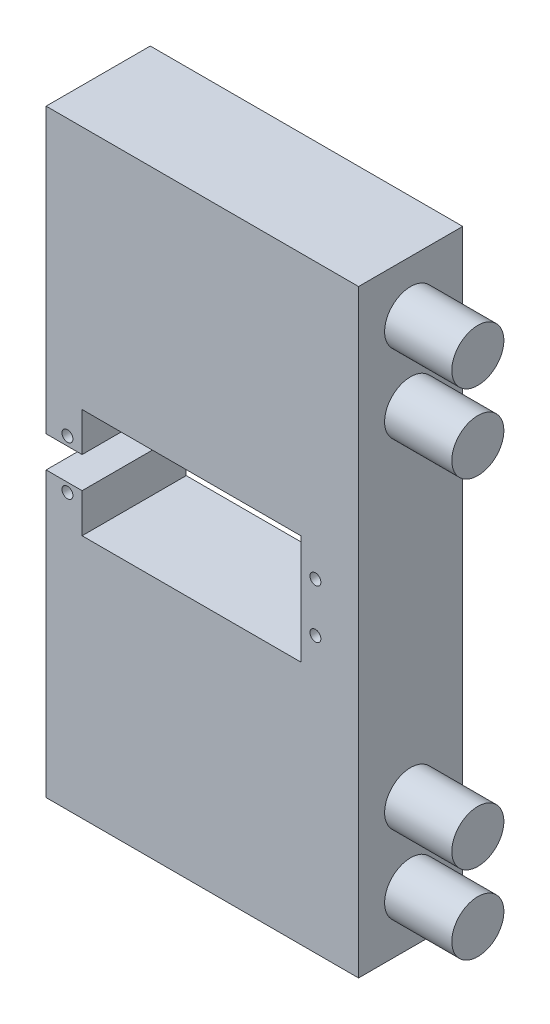
ISO-10303-21;
HEADER;
FILE_DESCRIPTION(('STEP AP214'),'2;1');
FILE_NAME('part.step','',(''),(''),'','','');
FILE_SCHEMA(('AUTOMOTIVE_DESIGN { 1 0 10303 214 1 1 1 1 }'));
ENDSEC;
DATA;
#1=APPLICATION_CONTEXT('core data for automotive mechanical design processes');
#2=APPLICATION_PROTOCOL_DEFINITION('international standard','automotive_design',2000,#1);
#3=PRODUCT_CONTEXT('',#1,'mechanical');
#4=PRODUCT('Part','Part','',(#3));
#5=PRODUCT_RELATED_PRODUCT_CATEGORY('part','',(#4));
#6=PRODUCT_DEFINITION_FORMATION('','',#4);
#7=PRODUCT_DEFINITION_CONTEXT('part definition',#1,'design');
#8=PRODUCT_DEFINITION('design','',#6,#7);
#9=PRODUCT_DEFINITION_SHAPE('','',#8);
#10=(LENGTH_UNIT() NAMED_UNIT(*) SI_UNIT(.MILLI.,.METRE.));
#11=(NAMED_UNIT(*) PLANE_ANGLE_UNIT() SI_UNIT($,.RADIAN.));
#12=(NAMED_UNIT(*) SI_UNIT($,.STERADIAN.) SOLID_ANGLE_UNIT());
#13=UNCERTAINTY_MEASURE_WITH_UNIT(LENGTH_MEASURE(1.E-05),#10,'distance_accuracy_value','');
#14=(GEOMETRIC_REPRESENTATION_CONTEXT(3) GLOBAL_UNCERTAINTY_ASSIGNED_CONTEXT((#13)) GLOBAL_UNIT_ASSIGNED_CONTEXT((#10,
#11,#12)) REPRESENTATION_CONTEXT('',''));
#15=CARTESIAN_POINT('',(0.,0.,0.));
#16=DIRECTION('',(0.,0.,1.));
#17=DIRECTION('',(1.,0.,0.));
#18=AXIS2_PLACEMENT_3D('',#15,#16,#17);
#19=CARTESIAN_POINT('',(0.,0.,0.));
#20=DIRECTION('',(0.,0.,1.));
#21=DIRECTION('',(1.,0.,0.));
#22=AXIS2_PLACEMENT_3D('',#19,#20,#21);
#23=PLANE('',#22);
#24=DIRECTION('',(0.,-1.,0.));
#25=VECTOR('',#24,1.);
#26=CARTESIAN_POINT('',(74.5,48.,0.));
#27=LINE('',#26,#25);
#28=CARTESIAN_POINT('',(74.5,48.,0.));
#29=VERTEX_POINT('',#28);
#30=CARTESIAN_POINT('',(74.5,27.,0.));
#31=VERTEX_POINT('',#30);
#32=EDGE_CURVE('E127',#29,#31,#27,.T.);
#33=ORIENTED_EDGE('',*,*,#32,.T.);
#34=DIRECTION('',(1.,0.,0.));
#35=VECTOR('',#34,1.);
#36=CARTESIAN_POINT('',(74.5,27.,0.));
#37=LINE('',#36,#35);
#38=CARTESIAN_POINT('',(95.5,27.,0.));
#39=VERTEX_POINT('',#38);
#40=EDGE_CURVE('E270',#31,#39,#37,.T.);
#41=ORIENTED_EDGE('',*,*,#40,.T.);
#42=DIRECTION('',(0.,-1.,0.));
#43=VECTOR('',#42,1.);
#44=CARTESIAN_POINT('',(95.5,48.,0.));
#45=LINE('',#44,#43);
#46=CARTESIAN_POINT('',(95.5,48.,0.));
#47=VERTEX_POINT('',#46);
#48=EDGE_CURVE('E296',#47,#39,#45,.T.);
#49=ORIENTED_EDGE('',*,*,#48,.F.);
#50=DIRECTION('',(1.,0.,0.));
#51=VECTOR('',#50,1.);
#52=CARTESIAN_POINT('',(74.5,48.,0.));
#53=LINE('',#52,#51);
#54=EDGE_CURVE('E281',#29,#47,#53,.T.);
#55=ORIENTED_EDGE('',*,*,#54,.F.);
#56=EDGE_LOOP('',(#33,#41,#49,#55));
#57=FACE_BOUND('',#56,.T.);
#58=CARTESIAN_POINT('',(59.19,-7.7,0.));
#59=DIRECTION('',(0.,0.,-1.));
#60=DIRECTION('',(-1.,0.,0.));
#61=AXIS2_PLACEMENT_3D('',#58,#59,#60);
#62=CIRCLE('',#61,1.05);
#63=CARTESIAN_POINT('',(58.14,-7.7,0.));
#64=VERTEX_POINT('',#63);
#65=EDGE_CURVE('E348',#64,#64,#62,.T.);
#66=ORIENTED_EDGE('',*,*,#65,.F.);
#67=EDGE_LOOP('',(#66));
#68=FACE_BOUND('',#67,.T.);
#69=CARTESIAN_POINT('',(106.81,-7.7,0.));
#70=DIRECTION('',(0.,0.,-1.));
#71=DIRECTION('',(-1.,0.,0.));
#72=AXIS2_PLACEMENT_3D('',#69,#70,#71);
#73=CIRCLE('',#72,1.04999999999999);
#74=CARTESIAN_POINT('',(105.76,-7.7,0.));
#75=VERTEX_POINT('',#74);
#76=EDGE_CURVE('E340',#75,#75,#73,.T.);
#77=ORIENTED_EDGE('',*,*,#76,.F.);
#78=EDGE_LOOP('',(#77));
#79=FACE_BOUND('',#78,.T.);
#80=DIRECTION('',(-1.,0.,0.));
#81=VECTOR('',#80,1.);
#82=CARTESIAN_POINT('',(0.,-6.,0.));
#83=LINE('',#82,#81);
#84=CARTESIAN_POINT('',(62.,-6.,0.));
#85=VERTEX_POINT('',#84);
#86=CARTESIAN_POINT('',(55.0953192291233,-6.,0.));
#87=VERTEX_POINT('',#86);
#88=EDGE_CURVE('E482',#85,#87,#83,.T.);
#89=ORIENTED_EDGE('',*,*,#88,.F.);
#90=DIRECTION('',(0.,-1.,0.));
#91=VECTOR('',#90,1.);
#92=CARTESIAN_POINT('',(62.,-6.,0.));
#93=LINE('',#92,#91);
#94=CARTESIAN_POINT('',(62.,-13.5,0.));
#95=VERTEX_POINT('',#94);
#96=EDGE_CURVE('E335',#85,#95,#93,.T.);
#97=ORIENTED_EDGE('',*,*,#96,.T.);
#98=DIRECTION('',(1.,0.,0.));
#99=VECTOR('',#98,1.);
#100=CARTESIAN_POINT('',(62.,-13.5,0.));
#101=LINE('',#100,#99);
#102=CARTESIAN_POINT('',(104.,-13.5,0.));
#103=VERTEX_POINT('',#102);
#104=EDGE_CURVE('E393',#95,#103,#101,.T.);
#105=ORIENTED_EDGE('',*,*,#104,.T.);
#106=DIRECTION('',(0.,-1.,0.));
#107=VECTOR('',#106,1.);
#108=CARTESIAN_POINT('',(104.,7.5,0.));
#109=LINE('',#108,#107);
#110=CARTESIAN_POINT('',(104.,7.5,0.));
#111=VERTEX_POINT('',#110);
#112=EDGE_CURVE('E397',#111,#103,#109,.T.);
#113=ORIENTED_EDGE('',*,*,#112,.F.);
#114=DIRECTION('',(1.,0.,0.));
#115=VECTOR('',#114,1.);
#116=CARTESIAN_POINT('',(62.,7.5,0.));
#117=LINE('',#116,#115);
#118=CARTESIAN_POINT('',(62.,7.5,0.));
#119=VERTEX_POINT('',#118);
#120=EDGE_CURVE('E401',#119,#111,#117,.T.);
#121=ORIENTED_EDGE('',*,*,#120,.F.);
#122=DIRECTION('',(0.,1.,0.));
#123=VECTOR('',#122,1.);
#124=CARTESIAN_POINT('',(62.,0.,0.));
#125=LINE('',#124,#123);
#126=CARTESIAN_POINT('',(62.,0.,0.));
#127=VERTEX_POINT('',#126);
#128=EDGE_CURVE('E367',#127,#119,#125,.T.);
#129=ORIENTED_EDGE('',*,*,#128,.F.);
#130=DIRECTION('',(-1.,0.,0.));
#131=VECTOR('',#130,1.);
#132=CARTESIAN_POINT('',(0.,0.,0.));
#133=LINE('',#132,#131);
#134=CARTESIAN_POINT('',(55.0953192291233,0.,0.));
#135=VERTEX_POINT('',#134);
#136=EDGE_CURVE('E478',#127,#135,#133,.T.);
#137=ORIENTED_EDGE('',*,*,#136,.T.);
#138=DIRECTION('',(0.,-1.,0.));
#139=VECTOR('',#138,1.);
#140=CARTESIAN_POINT('',(55.0953192291233,54.5,0.));
#141=LINE('',#140,#139);
#142=CARTESIAN_POINT('',(55.0953192291233,54.5,0.));
#143=VERTEX_POINT('',#142);
#144=EDGE_CURVE('E450',#143,#135,#141,.T.);
#145=ORIENTED_EDGE('',*,*,#144,.F.);
#146=DIRECTION('',(-1.,0.,0.));
#147=VECTOR('',#146,1.);
#148=CARTESIAN_POINT('',(55.0953192291233,54.5,0.));
#149=LINE('',#148,#147);
#150=CARTESIAN_POINT('',(115.095319229123,54.5,0.));
#151=VERTEX_POINT('',#150);
#152=EDGE_CURVE('E460',#151,#143,#149,.T.);
#153=ORIENTED_EDGE('',*,*,#152,.F.);
#154=DIRECTION('',(0.,1.,0.));
#155=VECTOR('',#154,1.);
#156=CARTESIAN_POINT('',(115.095319229123,54.5,0.));
#157=LINE('',#156,#155);
#158=CARTESIAN_POINT('',(115.095319229123,-60.5,0.));
#159=VERTEX_POINT('',#158);
#160=EDGE_CURVE('E457',#159,#151,#157,.T.);
#161=ORIENTED_EDGE('',*,*,#160,.F.);
#162=DIRECTION('',(1.,0.,0.));
#163=VECTOR('',#162,1.);
#164=CARTESIAN_POINT('',(55.0953192291233,-60.5,0.));
#165=LINE('',#164,#163);
#166=CARTESIAN_POINT('',(55.0953192291233,-60.5,0.));
#167=VERTEX_POINT('',#166);
#168=EDGE_CURVE('E454',#167,#159,#165,.T.);
#169=ORIENTED_EDGE('',*,*,#168,.F.);
#170=EDGE_CURVE('E434',#87,#167,#141,.T.);
#171=ORIENTED_EDGE('',*,*,#170,.F.);
#172=EDGE_LOOP('',(#89,#97,#105,#113,#121,#129,#137,#145,#153,#161,#169,#171));
#173=FACE_BOUND('',#172,.T.);
#174=CARTESIAN_POINT('',(106.81,1.7,0.));
#175=DIRECTION('',(0.,0.,1.));
#176=DIRECTION('',(1.,0.,0.));
#177=AXIS2_PLACEMENT_3D('',#174,#175,#176);
#178=CIRCLE('',#177,1.04999999999999);
#179=CARTESIAN_POINT('',(107.86,1.7,0.));
#180=VERTEX_POINT('',#179);
#181=EDGE_CURVE('E331',#180,#180,#178,.T.);
#182=ORIENTED_EDGE('',*,*,#181,.T.);
#183=EDGE_LOOP('',(#182));
#184=FACE_BOUND('',#183,.T.);
#185=CARTESIAN_POINT('',(59.19,1.7,0.));
#186=DIRECTION('',(0.,0.,1.));
#187=DIRECTION('',(1.,0.,0.));
#188=AXIS2_PLACEMENT_3D('',#185,#186,#187);
#189=CIRCLE('',#188,1.05);
#190=CARTESIAN_POINT('',(60.24,1.7,0.));
#191=VERTEX_POINT('',#190);
#192=EDGE_CURVE('E356',#191,#191,#189,.T.);
#193=ORIENTED_EDGE('',*,*,#192,.T.);
#194=EDGE_LOOP('',(#193));
#195=FACE_BOUND('',#194,.T.);
#196=DIRECTION('',(1.,0.,0.));
#197=VECTOR('',#196,1.);
#198=CARTESIAN_POINT('',(74.5,-54.,0.));
#199=LINE('',#198,#197);
#200=CARTESIAN_POINT('',(74.5,-54.,0.));
#201=VERTEX_POINT('',#200);
#202=CARTESIAN_POINT('',(95.5,-54.,0.));
#203=VERTEX_POINT('',#202);
#204=EDGE_CURVE('E119',#201,#203,#199,.T.);
#205=ORIENTED_EDGE('',*,*,#204,.T.);
#206=DIRECTION('',(0.,1.,0.));
#207=VECTOR('',#206,1.);
#208=CARTESIAN_POINT('',(95.5,-54.,0.));
#209=LINE('',#208,#207);
#210=CARTESIAN_POINT('',(95.5,-33.,0.));
#211=VERTEX_POINT('',#210);
#212=EDGE_CURVE('E264',#203,#211,#209,.T.);
#213=ORIENTED_EDGE('',*,*,#212,.T.);
#214=DIRECTION('',(1.,0.,0.));
#215=VECTOR('',#214,1.);
#216=CARTESIAN_POINT('',(74.5,-33.,0.));
#217=LINE('',#216,#215);
#218=CARTESIAN_POINT('',(74.5,-33.,0.));
#219=VERTEX_POINT('',#218);
#220=EDGE_CURVE('E611',#219,#211,#217,.T.);
#221=ORIENTED_EDGE('',*,*,#220,.F.);
#222=DIRECTION('',(0.,1.,0.));
#223=VECTOR('',#222,1.);
#224=CARTESIAN_POINT('',(74.5,-54.,0.));
#225=LINE('',#224,#223);
#226=EDGE_CURVE('E260',#201,#219,#225,.T.);
#227=ORIENTED_EDGE('',*,*,#226,.F.);
#228=EDGE_LOOP('',(#205,#213,#221,#227));
#229=FACE_BOUND('',#228,.T.);
#230=ADVANCED_FACE('F103',(#57,#68,#79,#173,#184,#195,#229),#23,.F.);
#231=CARTESIAN_POINT('',(55.0953192291233,54.5,20.));
#232=DIRECTION('',(1.,0.,0.));
#233=DIRECTION('',(0.,1.,0.));
#234=AXIS2_PLACEMENT_3D('',#231,#232,#233);
#235=PLANE('',#234);
#236=DIRECTION('',(0.,0.,1.));
#237=VECTOR('',#236,1.);
#238=CARTESIAN_POINT('',(55.0953192291233,-6.,20.));
#239=LINE('',#238,#237);
#240=CARTESIAN_POINT('',(55.0953192291233,-6.,20.));
#241=VERTEX_POINT('',#240);
#242=EDGE_CURVE('E431',#87,#241,#239,.T.);
#243=ORIENTED_EDGE('',*,*,#242,.F.);
#244=ORIENTED_EDGE('',*,*,#170,.T.);
#245=DIRECTION('',(0.,0.,-1.));
#246=VECTOR('',#245,1.);
#247=CARTESIAN_POINT('',(55.0953192291233,-60.5,20.));
#248=LINE('',#247,#246);
#249=CARTESIAN_POINT('',(55.0953192291233,-60.5,20.));
#250=VERTEX_POINT('',#249);
#251=EDGE_CURVE('E474',#250,#167,#248,.T.);
#252=ORIENTED_EDGE('',*,*,#251,.F.);
#253=DIRECTION('',(0.,-1.,0.));
#254=VECTOR('',#253,1.);
#255=CARTESIAN_POINT('',(55.0953192291233,54.5,20.));
#256=LINE('',#255,#254);
#257=EDGE_CURVE('E440',#241,#250,#256,.T.);
#258=ORIENTED_EDGE('',*,*,#257,.F.);
#259=EDGE_LOOP('',(#243,#244,#252,#258));
#260=FACE_BOUND('',#259,.T.);
#261=ADVANCED_FACE('F539',(#260),#235,.F.);
#262=CARTESIAN_POINT('',(0.,0.,20.));
#263=DIRECTION('',(0.,0.,1.));
#264=DIRECTION('',(1.,0.,0.));
#265=AXIS2_PLACEMENT_3D('',#262,#263,#264);
#266=PLANE('',#265);
#267=CARTESIAN_POINT('',(106.81,1.7,20.));
#268=DIRECTION('',(0.,0.,1.));
#269=DIRECTION('',(1.,0.,0.));
#270=AXIS2_PLACEMENT_3D('',#267,#268,#269);
#271=CIRCLE('',#270,1.04999999999999);
#272=CARTESIAN_POINT('',(107.86,1.7,20.));
#273=VERTEX_POINT('',#272);
#274=EDGE_CURVE('E336',#273,#273,#271,.T.);
#275=ORIENTED_EDGE('',*,*,#274,.F.);
#276=EDGE_LOOP('',(#275));
#277=FACE_BOUND('',#276,.T.);
#278=DIRECTION('',(0.,-1.,0.));
#279=VECTOR('',#278,1.);
#280=CARTESIAN_POINT('',(62.,-6.,20.));
#281=LINE('',#280,#279);
#282=CARTESIAN_POINT('',(62.,-6.,20.));
#283=VERTEX_POINT('',#282);
#284=CARTESIAN_POINT('',(62.,-13.5,20.));
#285=VERTEX_POINT('',#284);
#286=EDGE_CURVE('E366',#283,#285,#281,.T.);
#287=ORIENTED_EDGE('',*,*,#286,.F.);
#288=DIRECTION('',(1.,0.,0.));
#289=VECTOR('',#288,1.);
#290=CARTESIAN_POINT('',(55.,-6.,20.));
#291=LINE('',#290,#289);
#292=EDGE_CURVE('E363',#241,#283,#291,.T.);
#293=ORIENTED_EDGE('',*,*,#292,.F.);
#294=ORIENTED_EDGE('',*,*,#257,.T.);
#295=DIRECTION('',(1.,0.,0.));
#296=VECTOR('',#295,1.);
#297=CARTESIAN_POINT('',(55.0953192291233,-60.5,20.));
#298=LINE('',#297,#296);
#299=CARTESIAN_POINT('',(115.095319229123,-60.5,20.));
#300=VERTEX_POINT('',#299);
#301=EDGE_CURVE('E439',#250,#300,#298,.T.);
#302=ORIENTED_EDGE('',*,*,#301,.T.);
#303=DIRECTION('',(0.,1.,0.));
#304=VECTOR('',#303,1.);
#305=CARTESIAN_POINT('',(115.095319229123,54.5,20.));
#306=LINE('',#305,#304);
#307=CARTESIAN_POINT('',(115.095319229123,54.5,20.));
#308=VERTEX_POINT('',#307);
#309=EDGE_CURVE('E443',#300,#308,#306,.T.);
#310=ORIENTED_EDGE('',*,*,#309,.T.);
#311=DIRECTION('',(-1.,0.,0.));
#312=VECTOR('',#311,1.);
#313=CARTESIAN_POINT('',(55.0953192291233,54.5,20.));
#314=LINE('',#313,#312);
#315=CARTESIAN_POINT('',(55.0953192291233,54.5,20.));
#316=VERTEX_POINT('',#315);
#317=EDGE_CURVE('E446',#308,#316,#314,.T.);
#318=ORIENTED_EDGE('',*,*,#317,.T.);
#319=CARTESIAN_POINT('',(55.0953192291233,0.,20.));
#320=VERTEX_POINT('',#319);
#321=EDGE_CURVE('E435',#316,#320,#256,.T.);
#322=ORIENTED_EDGE('',*,*,#321,.T.);
#323=DIRECTION('',(1.,0.,0.));
#324=VECTOR('',#323,1.);
#325=CARTESIAN_POINT('',(55.,0.,20.));
#326=LINE('',#325,#324);
#327=CARTESIAN_POINT('',(62.,0.,20.));
#328=VERTEX_POINT('',#327);
#329=EDGE_CURVE('E385',#320,#328,#326,.T.);
#330=ORIENTED_EDGE('',*,*,#329,.T.);
#331=DIRECTION('',(0.,1.,0.));
#332=VECTOR('',#331,1.);
#333=CARTESIAN_POINT('',(62.,0.,20.));
#334=LINE('',#333,#332);
#335=CARTESIAN_POINT('',(62.,7.5,20.));
#336=VERTEX_POINT('',#335);
#337=EDGE_CURVE('E381',#328,#336,#334,.T.);
#338=ORIENTED_EDGE('',*,*,#337,.T.);
#339=DIRECTION('',(1.,0.,0.));
#340=VECTOR('',#339,1.);
#341=CARTESIAN_POINT('',(62.,7.5,20.));
#342=LINE('',#341,#340);
#343=CARTESIAN_POINT('',(104.,7.5,20.));
#344=VERTEX_POINT('',#343);
#345=EDGE_CURVE('E377',#336,#344,#342,.T.);
#346=ORIENTED_EDGE('',*,*,#345,.T.);
#347=DIRECTION('',(0.,-1.,0.));
#348=VECTOR('',#347,1.);
#349=CARTESIAN_POINT('',(104.,7.5,20.));
#350=LINE('',#349,#348);
#351=CARTESIAN_POINT('',(104.,-13.5,20.));
#352=VERTEX_POINT('',#351);
#353=EDGE_CURVE('E373',#344,#352,#350,.T.);
#354=ORIENTED_EDGE('',*,*,#353,.T.);
#355=DIRECTION('',(1.,0.,0.));
#356=VECTOR('',#355,1.);
#357=CARTESIAN_POINT('',(62.,-13.5,20.));
#358=LINE('',#357,#356);
#359=EDGE_CURVE('E370',#285,#352,#358,.T.);
#360=ORIENTED_EDGE('',*,*,#359,.F.);
#361=EDGE_LOOP('',(#287,#293,#294,#302,#310,#318,#322,#330,#338,#346,#354,#360));
#362=FACE_BOUND('',#361,.T.);
#363=CARTESIAN_POINT('',(106.81,-7.7,20.));
#364=DIRECTION('',(0.,0.,-1.));
#365=DIRECTION('',(-1.,0.,0.));
#366=AXIS2_PLACEMENT_3D('',#363,#364,#365);
#367=CIRCLE('',#366,1.04999999999999);
#368=CARTESIAN_POINT('',(105.76,-7.7,20.));
#369=VERTEX_POINT('',#368);
#370=EDGE_CURVE('E344',#369,#369,#367,.T.);
#371=ORIENTED_EDGE('',*,*,#370,.T.);
#372=EDGE_LOOP('',(#371));
#373=FACE_BOUND('',#372,.T.);
#374=CARTESIAN_POINT('',(59.19,-7.7,20.));
#375=DIRECTION('',(0.,0.,-1.));
#376=DIRECTION('',(-1.,0.,0.));
#377=AXIS2_PLACEMENT_3D('',#374,#375,#376);
#378=CIRCLE('',#377,1.05);
#379=CARTESIAN_POINT('',(58.14,-7.7,20.));
#380=VERTEX_POINT('',#379);
#381=EDGE_CURVE('E352',#380,#380,#378,.T.);
#382=ORIENTED_EDGE('',*,*,#381,.T.);
#383=EDGE_LOOP('',(#382));
#384=FACE_BOUND('',#383,.T.);
#385=CARTESIAN_POINT('',(59.19,1.7,20.));
#386=DIRECTION('',(0.,0.,1.));
#387=DIRECTION('',(1.,0.,0.));
#388=AXIS2_PLACEMENT_3D('',#385,#386,#387);
#389=CIRCLE('',#388,1.05);
#390=CARTESIAN_POINT('',(60.24,1.7,20.));
#391=VERTEX_POINT('',#390);
#392=EDGE_CURVE('E330',#391,#391,#389,.T.);
#393=ORIENTED_EDGE('',*,*,#392,.F.);
#394=EDGE_LOOP('',(#393));
#395=FACE_BOUND('',#394,.T.);
#396=ADVANCED_FACE('F527',(#277,#362,#373,#384,#395),#266,.T.);
#397=ORIENTED_EDGE('',*,*,#144,.T.);
#398=DIRECTION('',(0.,0.,1.));
#399=VECTOR('',#398,1.);
#400=CARTESIAN_POINT('',(55.0953192291233,0.,20.));
#401=LINE('',#400,#399);
#402=EDGE_CURVE('E427',#135,#320,#401,.T.);
#403=ORIENTED_EDGE('',*,*,#402,.T.);
#404=ORIENTED_EDGE('',*,*,#321,.F.);
#405=DIRECTION('',(0.,0.,-1.));
#406=VECTOR('',#405,1.);
#407=CARTESIAN_POINT('',(55.0953192291233,54.5,20.));
#408=LINE('',#407,#406);
#409=EDGE_CURVE('E449',#316,#143,#408,.T.);
#410=ORIENTED_EDGE('',*,*,#409,.T.);
#411=EDGE_LOOP('',(#397,#403,#404,#410));
#412=FACE_BOUND('',#411,.T.);
#413=ADVANCED_FACE('F105',(#412),#235,.F.);
#414=CARTESIAN_POINT('',(55.0953192291233,-60.5,20.));
#415=DIRECTION('',(0.,1.,0.));
#416=DIRECTION('',(-1.,0.,0.));
#417=AXIS2_PLACEMENT_3D('',#414,#415,#416);
#418=PLANE('',#417);
#419=ORIENTED_EDGE('',*,*,#168,.T.);
#420=DIRECTION('',(0.,0.,-1.));
#421=VECTOR('',#420,1.);
#422=CARTESIAN_POINT('',(115.095319229123,-60.5,20.));
#423=LINE('',#422,#421);
#424=EDGE_CURVE('E470',#300,#159,#423,.T.);
#425=ORIENTED_EDGE('',*,*,#424,.F.);
#426=ORIENTED_EDGE('',*,*,#301,.F.);
#427=ORIENTED_EDGE('',*,*,#251,.T.);
#428=EDGE_LOOP('',(#419,#425,#426,#427));
#429=FACE_BOUND('',#428,.T.);
#430=ADVANCED_FACE('F502',(#429),#418,.F.);
#431=CARTESIAN_POINT('',(115.095319229123,54.5,20.));
#432=DIRECTION('',(-1.,0.,0.));
#433=DIRECTION('',(0.,-1.,0.));
#434=AXIS2_PLACEMENT_3D('',#431,#432,#433);
#435=PLANE('',#434);
#436=CARTESIAN_POINT('',(115.095319229123,-50.5,10.));
#437=DIRECTION('',(-1.,0.,0.));
#438=DIRECTION('',(0.,-1.,0.));
#439=AXIS2_PLACEMENT_3D('',#436,#437,#438);
#440=CIRCLE('',#439,5.);
#441=CARTESIAN_POINT('',(115.095319229123,-55.5,10.));
#442=VERTEX_POINT('',#441);
#443=EDGE_CURVE('E12',#442,#442,#440,.F.);
#444=ORIENTED_EDGE('',*,*,#443,.F.);
#445=EDGE_LOOP('',(#444));
#446=FACE_BOUND('',#445,.T.);
#447=CARTESIAN_POINT('',(115.095319229123,-35.5,10.));
#448=DIRECTION('',(-1.,0.,0.));
#449=DIRECTION('',(0.,-1.,0.));
#450=AXIS2_PLACEMENT_3D('',#447,#448,#449);
#451=CIRCLE('',#450,5.);
#452=CARTESIAN_POINT('',(115.095319229123,-40.5,10.));
#453=VERTEX_POINT('',#452);
#454=EDGE_CURVE('E112',#453,#453,#451,.F.);
#455=ORIENTED_EDGE('',*,*,#454,.F.);
#456=EDGE_LOOP('',(#455));
#457=FACE_BOUND('',#456,.T.);
#458=CARTESIAN_POINT('',(115.095319229123,29.5,10.));
#459=DIRECTION('',(-1.,0.,0.));
#460=DIRECTION('',(0.,-1.,0.));
#461=AXIS2_PLACEMENT_3D('',#458,#459,#460);
#462=CIRCLE('',#461,5.);
#463=CARTESIAN_POINT('',(115.095319229123,24.5,10.));
#464=VERTEX_POINT('',#463);
#465=EDGE_CURVE('E489',#464,#464,#462,.F.);
#466=ORIENTED_EDGE('',*,*,#465,.F.);
#467=EDGE_LOOP('',(#466));
#468=FACE_BOUND('',#467,.T.);
#469=CARTESIAN_POINT('',(115.095319229123,44.5,10.));
#470=DIRECTION('',(-1.,0.,0.));
#471=DIRECTION('',(0.,-1.,0.));
#472=AXIS2_PLACEMENT_3D('',#469,#470,#471);
#473=CIRCLE('',#472,5.);
#474=CARTESIAN_POINT('',(115.095319229123,39.5,10.));
#475=VERTEX_POINT('',#474);
#476=EDGE_CURVE('E485',#475,#475,#473,.F.);
#477=ORIENTED_EDGE('',*,*,#476,.F.);
#478=EDGE_LOOP('',(#477));
#479=FACE_BOUND('',#478,.T.);
#480=ORIENTED_EDGE('',*,*,#160,.T.);
#481=DIRECTION('',(0.,0.,-1.));
#482=VECTOR('',#481,1.);
#483=CARTESIAN_POINT('',(115.095319229123,54.5,20.));
#484=LINE('',#483,#482);
#485=EDGE_CURVE('E466',#308,#151,#484,.T.);
#486=ORIENTED_EDGE('',*,*,#485,.F.);
#487=ORIENTED_EDGE('',*,*,#309,.F.);
#488=ORIENTED_EDGE('',*,*,#424,.T.);
#489=EDGE_LOOP('',(#480,#486,#487,#488));
#490=FACE_BOUND('',#489,.T.);
#491=ADVANCED_FACE('F498',(#446,#457,#468,#479,#490),#435,.F.);
#492=CARTESIAN_POINT('',(55.0953192291233,54.5,20.));
#493=DIRECTION('',(0.,-1.,0.));
#494=DIRECTION('',(0.,0.,-1.));
#495=AXIS2_PLACEMENT_3D('',#492,#493,#494);
#496=PLANE('',#495);
#497=ORIENTED_EDGE('',*,*,#152,.T.);
#498=ORIENTED_EDGE('',*,*,#409,.F.);
#499=ORIENTED_EDGE('',*,*,#317,.F.);
#500=ORIENTED_EDGE('',*,*,#485,.T.);
#501=EDGE_LOOP('',(#497,#498,#499,#500));
#502=FACE_BOUND('',#501,.T.);
#503=ADVANCED_FACE('F501',(#502),#496,.F.);
#504=CARTESIAN_POINT('',(55.,-6.,20.));
#505=DIRECTION('',(0.,1.,0.));
#506=DIRECTION('',(0.,0.,1.));
#507=AXIS2_PLACEMENT_3D('',#504,#505,#506);
#508=PLANE('',#507);
#509=ORIENTED_EDGE('',*,*,#242,.T.);
#510=ORIENTED_EDGE('',*,*,#292,.T.);
#511=DIRECTION('',(0.,0.,-1.));
#512=VECTOR('',#511,1.);
#513=CARTESIAN_POINT('',(62.,-6.,20.));
#514=LINE('',#513,#512);
#515=EDGE_CURVE('E423',#283,#85,#514,.T.);
#516=ORIENTED_EDGE('',*,*,#515,.T.);
#517=ORIENTED_EDGE('',*,*,#88,.T.);
#518=EDGE_LOOP('',(#509,#510,#516,#517));
#519=FACE_BOUND('',#518,.T.);
#520=ADVANCED_FACE('F541',(#519),#508,.T.);
#521=CARTESIAN_POINT('',(55.,0.,20.));
#522=DIRECTION('',(0.,1.,0.));
#523=DIRECTION('',(0.,0.,1.));
#524=AXIS2_PLACEMENT_3D('',#521,#522,#523);
#525=PLANE('',#524);
#526=ORIENTED_EDGE('',*,*,#136,.F.);
#527=DIRECTION('',(0.,0.,-1.));
#528=VECTOR('',#527,1.);
#529=CARTESIAN_POINT('',(62.,0.,20.));
#530=LINE('',#529,#528);
#531=EDGE_CURVE('E389',#328,#127,#530,.T.);
#532=ORIENTED_EDGE('',*,*,#531,.F.);
#533=ORIENTED_EDGE('',*,*,#329,.F.);
#534=ORIENTED_EDGE('',*,*,#402,.F.);
#535=EDGE_LOOP('',(#526,#532,#533,#534));
#536=FACE_BOUND('',#535,.T.);
#537=ADVANCED_FACE('F563',(#536),#525,.F.);
#538=CARTESIAN_POINT('',(62.,-6.,20.));
#539=DIRECTION('',(1.,0.,0.));
#540=DIRECTION('',(0.,1.,0.));
#541=AXIS2_PLACEMENT_3D('',#538,#539,#540);
#542=PLANE('',#541);
#543=ORIENTED_EDGE('',*,*,#96,.F.);
#544=ORIENTED_EDGE('',*,*,#515,.F.);
#545=ORIENTED_EDGE('',*,*,#286,.T.);
#546=DIRECTION('',(0.,0.,-1.));
#547=VECTOR('',#546,1.);
#548=CARTESIAN_POINT('',(62.,-13.5,20.));
#549=LINE('',#548,#547);
#550=EDGE_CURVE('E420',#285,#95,#549,.T.);
#551=ORIENTED_EDGE('',*,*,#550,.T.);
#552=EDGE_LOOP('',(#543,#544,#545,#551));
#553=FACE_BOUND('',#552,.T.);
#554=ADVANCED_FACE('F546',(#553),#542,.T.);
#555=CARTESIAN_POINT('',(62.,-13.5,20.));
#556=DIRECTION('',(0.,1.,0.));
#557=DIRECTION('',(0.,0.,1.));
#558=AXIS2_PLACEMENT_3D('',#555,#556,#557);
#559=PLANE('',#558);
#560=ORIENTED_EDGE('',*,*,#104,.F.);
#561=ORIENTED_EDGE('',*,*,#550,.F.);
#562=ORIENTED_EDGE('',*,*,#359,.T.);
#563=DIRECTION('',(0.,0.,-1.));
#564=VECTOR('',#563,1.);
#565=CARTESIAN_POINT('',(104.,-13.5,20.));
#566=LINE('',#565,#564);
#567=EDGE_CURVE('E417',#352,#103,#566,.T.);
#568=ORIENTED_EDGE('',*,*,#567,.T.);
#569=EDGE_LOOP('',(#560,#561,#562,#568));
#570=FACE_BOUND('',#569,.T.);
#571=ADVANCED_FACE('F549',(#570),#559,.T.);
#572=CARTESIAN_POINT('',(104.,7.5,20.));
#573=DIRECTION('',(1.,0.,0.));
#574=DIRECTION('',(0.,0.,-1.));
#575=AXIS2_PLACEMENT_3D('',#572,#573,#574);
#576=PLANE('',#575);
#577=ORIENTED_EDGE('',*,*,#112,.T.);
#578=ORIENTED_EDGE('',*,*,#567,.F.);
#579=ORIENTED_EDGE('',*,*,#353,.F.);
#580=DIRECTION('',(0.,0.,-1.));
#581=VECTOR('',#580,1.);
#582=CARTESIAN_POINT('',(104.,7.5,20.));
#583=LINE('',#582,#581);
#584=EDGE_CURVE('E414',#344,#111,#583,.T.);
#585=ORIENTED_EDGE('',*,*,#584,.T.);
#586=EDGE_LOOP('',(#577,#578,#579,#585));
#587=FACE_BOUND('',#586,.T.);
#588=ADVANCED_FACE('F554',(#587),#576,.F.);
#589=CARTESIAN_POINT('',(62.,7.5,20.));
#590=DIRECTION('',(0.,1.,0.));
#591=DIRECTION('',(0.,0.,1.));
#592=AXIS2_PLACEMENT_3D('',#589,#590,#591);
#593=PLANE('',#592);
#594=ORIENTED_EDGE('',*,*,#120,.T.);
#595=ORIENTED_EDGE('',*,*,#584,.F.);
#596=ORIENTED_EDGE('',*,*,#345,.F.);
#597=DIRECTION('',(0.,0.,-1.));
#598=VECTOR('',#597,1.);
#599=CARTESIAN_POINT('',(62.,7.5,20.));
#600=LINE('',#599,#598);
#601=EDGE_CURVE('E411',#336,#119,#600,.T.);
#602=ORIENTED_EDGE('',*,*,#601,.T.);
#603=EDGE_LOOP('',(#594,#595,#596,#602));
#604=FACE_BOUND('',#603,.T.);
#605=ADVANCED_FACE('F558',(#604),#593,.F.);
#606=CARTESIAN_POINT('',(62.,0.,20.));
#607=DIRECTION('',(-1.,0.,0.));
#608=DIRECTION('',(0.,-1.,0.));
#609=AXIS2_PLACEMENT_3D('',#606,#607,#608);
#610=PLANE('',#609);
#611=ORIENTED_EDGE('',*,*,#128,.T.);
#612=ORIENTED_EDGE('',*,*,#601,.F.);
#613=ORIENTED_EDGE('',*,*,#337,.F.);
#614=ORIENTED_EDGE('',*,*,#531,.T.);
#615=EDGE_LOOP('',(#611,#612,#613,#614));
#616=FACE_BOUND('',#615,.T.);
#617=ADVANCED_FACE('F561',(#616),#610,.F.);
#618=CARTESIAN_POINT('',(106.81,1.7,20.));
#619=DIRECTION('',(0.,0.,-1.));
#620=DIRECTION('',(-1.,0.,0.));
#621=AXIS2_PLACEMENT_3D('',#618,#619,#620);
#622=CYLINDRICAL_SURFACE('',#621,1.04999999999999);
#623=ORIENTED_EDGE('',*,*,#274,.T.);
#624=EDGE_LOOP('',(#623));
#625=FACE_BOUND('',#624,.T.);
#626=ORIENTED_EDGE('',*,*,#181,.F.);
#627=EDGE_LOOP('',(#626));
#628=FACE_BOUND('',#627,.T.);
#629=ADVANCED_FACE('F596',(#625,#628),#622,.F.);
#630=CARTESIAN_POINT('',(106.81,-7.7,20.));
#631=DIRECTION('',(0.,0.,-1.));
#632=DIRECTION('',(-1.,0.,0.));
#633=AXIS2_PLACEMENT_3D('',#630,#631,#632);
#634=CYLINDRICAL_SURFACE('',#633,1.04999999999999);
#635=ORIENTED_EDGE('',*,*,#370,.F.);
#636=EDGE_LOOP('',(#635));
#637=FACE_BOUND('',#636,.T.);
#638=ORIENTED_EDGE('',*,*,#76,.T.);
#639=EDGE_LOOP('',(#638));
#640=FACE_BOUND('',#639,.T.);
#641=ADVANCED_FACE('F599',(#637,#640),#634,.F.);
#642=CARTESIAN_POINT('',(59.19,-7.7,20.));
#643=DIRECTION('',(0.,0.,-1.));
#644=DIRECTION('',(-1.,0.,0.));
#645=AXIS2_PLACEMENT_3D('',#642,#643,#644);
#646=CYLINDRICAL_SURFACE('',#645,1.05);
#647=ORIENTED_EDGE('',*,*,#381,.F.);
#648=EDGE_LOOP('',(#647));
#649=FACE_BOUND('',#648,.T.);
#650=ORIENTED_EDGE('',*,*,#65,.T.);
#651=EDGE_LOOP('',(#650));
#652=FACE_BOUND('',#651,.T.);
#653=ADVANCED_FACE('F696',(#649,#652),#646,.F.);
#654=CARTESIAN_POINT('',(59.19,1.7,20.));
#655=DIRECTION('',(0.,0.,-1.));
#656=DIRECTION('',(-1.,0.,0.));
#657=AXIS2_PLACEMENT_3D('',#654,#655,#656);
#658=CYLINDRICAL_SURFACE('',#657,1.05);
#659=ORIENTED_EDGE('',*,*,#392,.T.);
#660=EDGE_LOOP('',(#659));
#661=FACE_BOUND('',#660,.T.);
#662=ORIENTED_EDGE('',*,*,#192,.F.);
#663=EDGE_LOOP('',(#662));
#664=FACE_BOUND('',#663,.T.);
#665=ADVANCED_FACE('F691',(#661,#664),#658,.F.);
#666=CARTESIAN_POINT('',(128.,44.5,10.));
#667=DIRECTION('',(-1.,0.,0.));
#668=DIRECTION('',(0.,0.,1.));
#669=AXIS2_PLACEMENT_3D('',#666,#667,#668);
#670=CYLINDRICAL_SURFACE('',#669,5.);
#671=CARTESIAN_POINT('',(128.,44.5,10.));
#672=DIRECTION('',(1.,0.,0.));
#673=DIRECTION('',(0.,0.,-1.));
#674=AXIS2_PLACEMENT_3D('',#671,#672,#673);
#675=CIRCLE('',#674,5.);
#676=CARTESIAN_POINT('',(128.,44.5,5.00000000000001));
#677=VERTEX_POINT('',#676);
#678=EDGE_CURVE('E326',#677,#677,#675,.T.);
#679=ORIENTED_EDGE('',*,*,#678,.F.);
#680=EDGE_LOOP('',(#679));
#681=FACE_BOUND('',#680,.T.);
#682=ORIENTED_EDGE('',*,*,#476,.T.);
#683=EDGE_LOOP('',(#682));
#684=FACE_BOUND('',#683,.T.);
#685=ADVANCED_FACE('F688',(#681,#684),#670,.T.);
#686=CARTESIAN_POINT('',(128.,44.5,10.));
#687=DIRECTION('',(1.,0.,0.));
#688=DIRECTION('',(0.,0.,-1.));
#689=AXIS2_PLACEMENT_3D('',#686,#687,#688);
#690=PLANE('',#689);
#691=ORIENTED_EDGE('',*,*,#678,.T.);
#692=EDGE_LOOP('',(#691));
#693=FACE_BOUND('',#692,.T.);
#694=ADVANCED_FACE('F684',(#693),#690,.T.);
#695=CARTESIAN_POINT('',(128.,29.5,10.));
#696=DIRECTION('',(-1.,0.,0.));
#697=DIRECTION('',(0.,0.,1.));
#698=AXIS2_PLACEMENT_3D('',#695,#696,#697);
#699=CYLINDRICAL_SURFACE('',#698,5.);
#700=CARTESIAN_POINT('',(128.,29.5,10.));
#701=DIRECTION('',(1.,0.,0.));
#702=DIRECTION('',(0.,0.,-1.));
#703=AXIS2_PLACEMENT_3D('',#700,#701,#702);
#704=CIRCLE('',#703,5.);
#705=CARTESIAN_POINT('',(128.,29.5,5.00000000000001));
#706=VERTEX_POINT('',#705);
#707=EDGE_CURVE('E322',#706,#706,#704,.T.);
#708=ORIENTED_EDGE('',*,*,#707,.F.);
#709=EDGE_LOOP('',(#708));
#710=FACE_BOUND('',#709,.T.);
#711=ORIENTED_EDGE('',*,*,#465,.T.);
#712=EDGE_LOOP('',(#711));
#713=FACE_BOUND('',#712,.T.);
#714=ADVANCED_FACE('F680',(#710,#713),#699,.T.);
#715=CARTESIAN_POINT('',(128.,29.5,10.));
#716=DIRECTION('',(1.,0.,0.));
#717=DIRECTION('',(0.,0.,-1.));
#718=AXIS2_PLACEMENT_3D('',#715,#716,#717);
#719=PLANE('',#718);
#720=ORIENTED_EDGE('',*,*,#707,.T.);
#721=EDGE_LOOP('',(#720));
#722=FACE_BOUND('',#721,.T.);
#723=ADVANCED_FACE('F676',(#722),#719,.T.);
#724=CARTESIAN_POINT('',(128.,-35.5,10.));
#725=DIRECTION('',(-1.,0.,0.));
#726=DIRECTION('',(0.,0.,1.));
#727=AXIS2_PLACEMENT_3D('',#724,#725,#726);
#728=CYLINDRICAL_SURFACE('',#727,5.);
#729=CARTESIAN_POINT('',(128.,-35.5,10.));
#730=DIRECTION('',(1.,0.,0.));
#731=DIRECTION('',(0.,0.,1.));
#732=AXIS2_PLACEMENT_3D('',#729,#730,#731);
#733=CIRCLE('',#732,5.);
#734=CARTESIAN_POINT('',(128.,-35.5,15.));
#735=VERTEX_POINT('',#734);
#736=EDGE_CURVE('E318',#735,#735,#733,.T.);
#737=ORIENTED_EDGE('',*,*,#736,.F.);
#738=EDGE_LOOP('',(#737));
#739=FACE_BOUND('',#738,.T.);
#740=ORIENTED_EDGE('',*,*,#454,.T.);
#741=EDGE_LOOP('',(#740));
#742=FACE_BOUND('',#741,.T.);
#743=ADVANCED_FACE('F496',(#739,#742),#728,.T.);
#744=CARTESIAN_POINT('',(128.,-35.5,10.));
#745=DIRECTION('',(-1.,0.,0.));
#746=DIRECTION('',(0.,0.,1.));
#747=AXIS2_PLACEMENT_3D('',#744,#745,#746);
#748=PLANE('',#747);
#749=ORIENTED_EDGE('',*,*,#736,.T.);
#750=EDGE_LOOP('',(#749));
#751=FACE_BOUND('',#750,.T.);
#752=ADVANCED_FACE('F669',(#751),#748,.F.);
#753=CARTESIAN_POINT('',(128.,-50.5,10.));
#754=DIRECTION('',(-1.,0.,0.));
#755=DIRECTION('',(0.,0.,1.));
#756=AXIS2_PLACEMENT_3D('',#753,#754,#755);
#757=CYLINDRICAL_SURFACE('',#756,5.);
#758=CARTESIAN_POINT('',(128.,-50.5,10.));
#759=DIRECTION('',(1.,0.,0.));
#760=DIRECTION('',(0.,0.,1.));
#761=AXIS2_PLACEMENT_3D('',#758,#759,#760);
#762=CIRCLE('',#761,5.);
#763=CARTESIAN_POINT('',(128.,-50.5,15.));
#764=VERTEX_POINT('',#763);
#765=EDGE_CURVE('E314',#764,#764,#762,.T.);
#766=ORIENTED_EDGE('',*,*,#765,.F.);
#767=EDGE_LOOP('',(#766));
#768=FACE_BOUND('',#767,.T.);
#769=ORIENTED_EDGE('',*,*,#443,.T.);
#770=EDGE_LOOP('',(#769));
#771=FACE_BOUND('',#770,.T.);
#772=ADVANCED_FACE('F665',(#768,#771),#757,.T.);
#773=CARTESIAN_POINT('',(128.,-50.5,10.));
#774=DIRECTION('',(-1.,0.,0.));
#775=DIRECTION('',(0.,0.,1.));
#776=AXIS2_PLACEMENT_3D('',#773,#774,#775);
#777=PLANE('',#776);
#778=ORIENTED_EDGE('',*,*,#765,.T.);
#779=EDGE_LOOP('',(#778));
#780=FACE_BOUND('',#779,.T.);
#781=ADVANCED_FACE('F662',(#780),#777,.F.);
#782=CARTESIAN_POINT('',(74.5,48.,17.));
#783=DIRECTION('',(1.,0.,0.));
#784=DIRECTION('',(0.,1.,0.));
#785=AXIS2_PLACEMENT_3D('',#782,#783,#784);
#786=PLANE('',#785);
#787=ORIENTED_EDGE('',*,*,#32,.F.);
#788=DIRECTION('',(0.,0.,-1.));
#789=VECTOR('',#788,1.);
#790=CARTESIAN_POINT('',(74.5,48.,17.));
#791=LINE('',#790,#789);
#792=CARTESIAN_POINT('',(74.5,48.,17.));
#793=VERTEX_POINT('',#792);
#794=EDGE_CURVE('E291',#793,#29,#791,.T.);
#795=ORIENTED_EDGE('',*,*,#794,.F.);
#796=DIRECTION('',(0.,-1.,0.));
#797=VECTOR('',#796,1.);
#798=CARTESIAN_POINT('',(74.5,48.,17.));
#799=LINE('',#798,#797);
#800=CARTESIAN_POINT('',(74.5,27.,17.));
#801=VERTEX_POINT('',#800);
#802=EDGE_CURVE('E276',#793,#801,#799,.T.);
#803=ORIENTED_EDGE('',*,*,#802,.T.);
#804=DIRECTION('',(0.,0.,-1.));
#805=VECTOR('',#804,1.);
#806=CARTESIAN_POINT('',(74.5,27.,17.));
#807=LINE('',#806,#805);
#808=EDGE_CURVE('E311',#801,#31,#807,.T.);
#809=ORIENTED_EDGE('',*,*,#808,.T.);
#810=EDGE_LOOP('',(#787,#795,#803,#809));
#811=FACE_BOUND('',#810,.T.);
#812=ADVANCED_FACE('F658',(#811),#786,.T.);
#813=CARTESIAN_POINT('',(74.5,27.,17.));
#814=DIRECTION('',(0.,1.,0.));
#815=DIRECTION('',(-1.,0.,0.));
#816=AXIS2_PLACEMENT_3D('',#813,#814,#815);
#817=PLANE('',#816);
#818=ORIENTED_EDGE('',*,*,#40,.F.);
#819=ORIENTED_EDGE('',*,*,#808,.F.);
#820=DIRECTION('',(1.,0.,0.));
#821=VECTOR('',#820,1.);
#822=CARTESIAN_POINT('',(74.5,27.,17.));
#823=LINE('',#822,#821);
#824=CARTESIAN_POINT('',(95.5,27.,17.));
#825=VERTEX_POINT('',#824);
#826=EDGE_CURVE('E280',#801,#825,#823,.T.);
#827=ORIENTED_EDGE('',*,*,#826,.T.);
#828=DIRECTION('',(0.,0.,-1.));
#829=VECTOR('',#828,1.);
#830=CARTESIAN_POINT('',(95.5,27.,17.));
#831=LINE('',#830,#829);
#832=EDGE_CURVE('E308',#825,#39,#831,.T.);
#833=ORIENTED_EDGE('',*,*,#832,.T.);
#834=EDGE_LOOP('',(#818,#819,#827,#833));
#835=FACE_BOUND('',#834,.T.);
#836=ADVANCED_FACE('F654',(#835),#817,.T.);
#837=CARTESIAN_POINT('',(95.5,48.,17.));
#838=DIRECTION('',(1.,0.,0.));
#839=DIRECTION('',(0.,0.,-1.));
#840=AXIS2_PLACEMENT_3D('',#837,#838,#839);
#841=PLANE('',#840);
#842=ORIENTED_EDGE('',*,*,#48,.T.);
#843=ORIENTED_EDGE('',*,*,#832,.F.);
#844=DIRECTION('',(0.,-1.,0.));
#845=VECTOR('',#844,1.);
#846=CARTESIAN_POINT('',(95.5,48.,17.));
#847=LINE('',#846,#845);
#848=CARTESIAN_POINT('',(95.5,48.,17.));
#849=VERTEX_POINT('',#848);
#850=EDGE_CURVE('E284',#849,#825,#847,.T.);
#851=ORIENTED_EDGE('',*,*,#850,.F.);
#852=DIRECTION('',(0.,0.,-1.));
#853=VECTOR('',#852,1.);
#854=CARTESIAN_POINT('',(95.5,48.,17.));
#855=LINE('',#854,#853);
#856=EDGE_CURVE('E305',#849,#47,#855,.T.);
#857=ORIENTED_EDGE('',*,*,#856,.T.);
#858=EDGE_LOOP('',(#842,#843,#851,#857));
#859=FACE_BOUND('',#858,.T.);
#860=ADVANCED_FACE('F650',(#859),#841,.F.);
#861=CARTESIAN_POINT('',(74.5,48.,17.));
#862=DIRECTION('',(0.,1.,0.));
#863=DIRECTION('',(-1.,0.,0.));
#864=AXIS2_PLACEMENT_3D('',#861,#862,#863);
#865=PLANE('',#864);
#866=ORIENTED_EDGE('',*,*,#54,.T.);
#867=ORIENTED_EDGE('',*,*,#856,.F.);
#868=DIRECTION('',(1.,0.,0.));
#869=VECTOR('',#868,1.);
#870=CARTESIAN_POINT('',(74.5,48.,17.));
#871=LINE('',#870,#869);
#872=EDGE_CURVE('E288',#793,#849,#871,.T.);
#873=ORIENTED_EDGE('',*,*,#872,.F.);
#874=ORIENTED_EDGE('',*,*,#794,.T.);
#875=EDGE_LOOP('',(#866,#867,#873,#874));
#876=FACE_BOUND('',#875,.T.);
#877=ADVANCED_FACE('F646',(#876),#865,.F.);
#878=CARTESIAN_POINT('',(0.,0.,17.));
#879=DIRECTION('',(0.,0.,1.));
#880=DIRECTION('',(1.,0.,0.));
#881=AXIS2_PLACEMENT_3D('',#878,#879,#880);
#882=PLANE('',#881);
#883=ORIENTED_EDGE('',*,*,#802,.F.);
#884=ORIENTED_EDGE('',*,*,#872,.T.);
#885=ORIENTED_EDGE('',*,*,#850,.T.);
#886=ORIENTED_EDGE('',*,*,#826,.F.);
#887=EDGE_LOOP('',(#883,#884,#885,#886));
#888=FACE_BOUND('',#887,.T.);
#889=ADVANCED_FACE('F643',(#888),#882,.F.);
#890=CARTESIAN_POINT('',(74.5,-54.,17.));
#891=DIRECTION('',(0.,1.,0.));
#892=DIRECTION('',(-1.,0.,0.));
#893=AXIS2_PLACEMENT_3D('',#890,#891,#892);
#894=PLANE('',#893);
#895=ORIENTED_EDGE('',*,*,#204,.F.);
#896=DIRECTION('',(0.,0.,-1.));
#897=VECTOR('',#896,1.);
#898=CARTESIAN_POINT('',(74.5,-54.,17.));
#899=LINE('',#898,#897);
#900=CARTESIAN_POINT('',(74.5,-54.,17.));
#901=VERTEX_POINT('',#900);
#902=EDGE_CURVE('E258',#901,#201,#899,.T.);
#903=ORIENTED_EDGE('',*,*,#902,.F.);
#904=DIRECTION('',(1.,0.,0.));
#905=VECTOR('',#904,1.);
#906=CARTESIAN_POINT('',(74.5,-54.,17.));
#907=LINE('',#906,#905);
#908=CARTESIAN_POINT('',(95.5,-54.,17.));
#909=VERTEX_POINT('',#908);
#910=EDGE_CURVE('E247',#901,#909,#907,.T.);
#911=ORIENTED_EDGE('',*,*,#910,.T.);
#912=DIRECTION('',(0.,0.,-1.));
#913=VECTOR('',#912,1.);
#914=CARTESIAN_POINT('',(95.5,-54.,17.));
#915=LINE('',#914,#913);
#916=EDGE_CURVE('E257',#909,#203,#915,.T.);
#917=ORIENTED_EDGE('',*,*,#916,.T.);
#918=EDGE_LOOP('',(#895,#903,#911,#917));
#919=FACE_BOUND('',#918,.T.);
#920=ADVANCED_FACE('F256',(#919),#894,.T.);
#921=CARTESIAN_POINT('',(95.5,-54.,17.));
#922=DIRECTION('',(-1.,0.,0.));
#923=DIRECTION('',(0.,0.,1.));
#924=AXIS2_PLACEMENT_3D('',#921,#922,#923);
#925=PLANE('',#924);
#926=ORIENTED_EDGE('',*,*,#212,.F.);
#927=ORIENTED_EDGE('',*,*,#916,.F.);
#928=DIRECTION('',(0.,1.,0.));
#929=VECTOR('',#928,1.);
#930=CARTESIAN_POINT('',(95.5,-54.,17.));
#931=LINE('',#930,#929);
#932=CARTESIAN_POINT('',(95.5,-33.,17.));
#933=VERTEX_POINT('',#932);
#934=EDGE_CURVE('E243',#909,#933,#931,.T.);
#935=ORIENTED_EDGE('',*,*,#934,.T.);
#936=DIRECTION('',(0.,0.,-1.));
#937=VECTOR('',#936,1.);
#938=CARTESIAN_POINT('',(95.5,-33.,17.));
#939=LINE('',#938,#937);
#940=EDGE_CURVE('E266',#933,#211,#939,.T.);
#941=ORIENTED_EDGE('',*,*,#940,.T.);
#942=EDGE_LOOP('',(#926,#927,#935,#941));
#943=FACE_BOUND('',#942,.T.);
#944=ADVANCED_FACE('F262',(#943),#925,.T.);
#945=CARTESIAN_POINT('',(74.5,-33.,17.));
#946=DIRECTION('',(0.,1.,0.));
#947=DIRECTION('',(-1.,0.,0.));
#948=AXIS2_PLACEMENT_3D('',#945,#946,#947);
#949=PLANE('',#948);
#950=ORIENTED_EDGE('',*,*,#220,.T.);
#951=ORIENTED_EDGE('',*,*,#940,.F.);
#952=DIRECTION('',(1.,0.,0.));
#953=VECTOR('',#952,1.);
#954=CARTESIAN_POINT('',(74.5,-33.,17.));
#955=LINE('',#954,#953);
#956=CARTESIAN_POINT('',(74.5,-33.,17.));
#957=VERTEX_POINT('',#956);
#958=EDGE_CURVE('E250',#957,#933,#955,.T.);
#959=ORIENTED_EDGE('',*,*,#958,.F.);
#960=DIRECTION('',(0.,0.,-1.));
#961=VECTOR('',#960,1.);
#962=CARTESIAN_POINT('',(74.5,-33.,17.));
#963=LINE('',#962,#961);
#964=EDGE_CURVE('E272',#957,#219,#963,.T.);
#965=ORIENTED_EDGE('',*,*,#964,.T.);
#966=EDGE_LOOP('',(#950,#951,#959,#965));
#967=FACE_BOUND('',#966,.T.);
#968=ADVANCED_FACE('F625',(#967),#949,.F.);
#969=CARTESIAN_POINT('',(74.5,-54.,17.));
#970=DIRECTION('',(-1.,0.,0.));
#971=DIRECTION('',(0.,-1.,0.));
#972=AXIS2_PLACEMENT_3D('',#969,#970,#971);
#973=PLANE('',#972);
#974=ORIENTED_EDGE('',*,*,#226,.T.);
#975=ORIENTED_EDGE('',*,*,#964,.F.);
#976=DIRECTION('',(0.,1.,0.));
#977=VECTOR('',#976,1.);
#978=CARTESIAN_POINT('',(74.5,-54.,17.));
#979=LINE('',#978,#977);
#980=EDGE_CURVE('E614',#901,#957,#979,.T.);
#981=ORIENTED_EDGE('',*,*,#980,.F.);
#982=ORIENTED_EDGE('',*,*,#902,.T.);
#983=EDGE_LOOP('',(#974,#975,#981,#982));
#984=FACE_BOUND('',#983,.T.);
#985=ADVANCED_FACE('F627',(#984),#973,.F.);
#986=CARTESIAN_POINT('',(0.,0.,17.));
#987=DIRECTION('',(0.,0.,1.));
#988=DIRECTION('',(1.,0.,0.));
#989=AXIS2_PLACEMENT_3D('',#986,#987,#988);
#990=PLANE('',#989);
#991=ORIENTED_EDGE('',*,*,#910,.F.);
#992=ORIENTED_EDGE('',*,*,#980,.T.);
#993=ORIENTED_EDGE('',*,*,#958,.T.);
#994=ORIENTED_EDGE('',*,*,#934,.F.);
#995=EDGE_LOOP('',(#991,#992,#993,#994));
#996=FACE_BOUND('',#995,.T.);
#997=ADVANCED_FACE('F245',(#996),#990,.F.);
#998=CLOSED_SHELL('',(#230,#261,#396,#413,#430,#491,#503,#520,#537,#554,#571,#588,#605,#617,
#629,#641,#653,#665,#685,#694,#714,#723,#743,#752,#772,#781,#812,#836,#860,#877,#889,#920,#944,
#968,#985,#997));
#999=MANIFOLD_SOLID_BREP('B2',#998);
#1000=ADVANCED_BREP_SHAPE_REPRESENTATION('',(#18,#999),#14);
#1001=SHAPE_DEFINITION_REPRESENTATION(#9,#1000);
ENDSEC;
END-ISO-10303-21;
